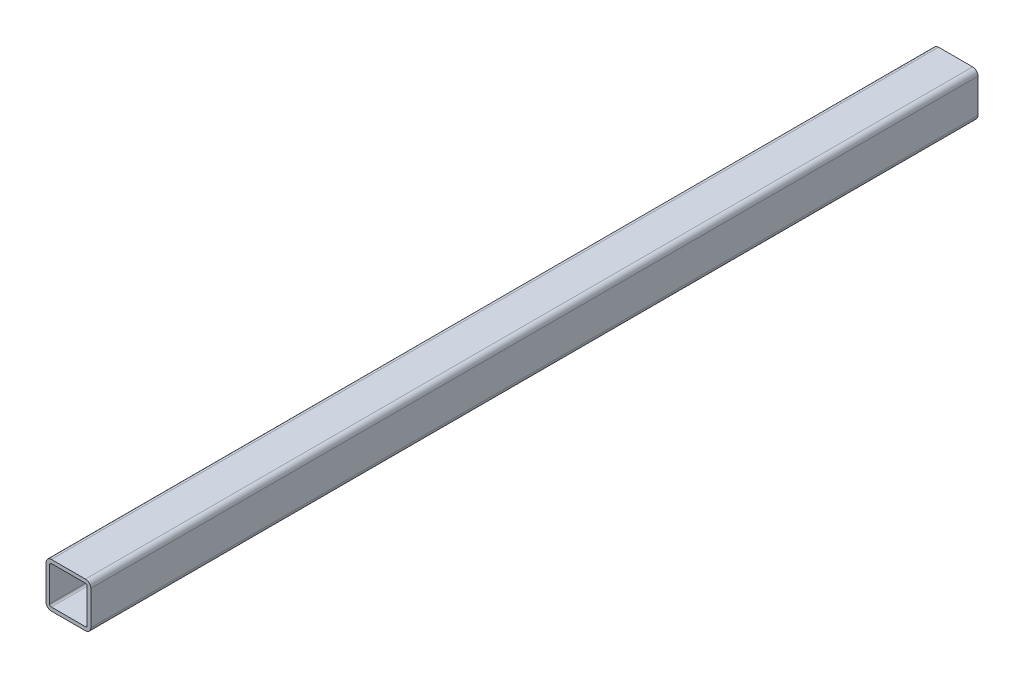
ISO-10303-21;
HEADER;
FILE_DESCRIPTION(('STEP AP214'),'2;1');
FILE_NAME('part.step','',(''),(''),'','','');
FILE_SCHEMA(('AUTOMOTIVE_DESIGN { 1 0 10303 214 1 1 1 1 }'));
ENDSEC;
DATA;
#1=APPLICATION_CONTEXT('core data for automotive mechanical design processes');
#2=APPLICATION_PROTOCOL_DEFINITION('international standard','automotive_design',2000,#1);
#3=PRODUCT_CONTEXT('',#1,'mechanical');
#4=PRODUCT('Part','Part','',(#3));
#5=PRODUCT_RELATED_PRODUCT_CATEGORY('part','',(#4));
#6=PRODUCT_DEFINITION_FORMATION('','',#4);
#7=PRODUCT_DEFINITION_CONTEXT('part definition',#1,'design');
#8=PRODUCT_DEFINITION('design','',#6,#7);
#9=PRODUCT_DEFINITION_SHAPE('','',#8);
#10=(LENGTH_UNIT() NAMED_UNIT(*) SI_UNIT(.MILLI.,.METRE.));
#11=(NAMED_UNIT(*) PLANE_ANGLE_UNIT() SI_UNIT($,.RADIAN.));
#12=(NAMED_UNIT(*) SI_UNIT($,.STERADIAN.) SOLID_ANGLE_UNIT());
#13=UNCERTAINTY_MEASURE_WITH_UNIT(LENGTH_MEASURE(1.E-05),#10,'distance_accuracy_value','');
#14=(GEOMETRIC_REPRESENTATION_CONTEXT(3) GLOBAL_UNCERTAINTY_ASSIGNED_CONTEXT((#13)) GLOBAL_UNIT_ASSIGNED_CONTEXT((#10,
#11,#12)) REPRESENTATION_CONTEXT('',''));
#15=CARTESIAN_POINT('',(0.,0.,0.));
#16=DIRECTION('',(0.,0.,1.));
#17=DIRECTION('',(1.,0.,0.));
#18=AXIS2_PLACEMENT_3D('',#15,#16,#17);
#19=CARTESIAN_POINT('',(0.,0.,495.));
#20=DIRECTION('',(0.,0.,1.));
#21=DIRECTION('',(1.,0.,0.));
#22=AXIS2_PLACEMENT_3D('',#19,#20,#21);
#23=PLANE('',#22);
#24=DIRECTION('',(0.,1.,0.));
#25=VECTOR('',#24,1.);
#26=CARTESIAN_POINT('',(-12.5,-4.75,495.));
#27=LINE('',#26,#25);
#28=CARTESIAN_POINT('',(-12.5,-9.5,495.));
#29=VERTEX_POINT('',#28);
#30=CARTESIAN_POINT('',(-12.5,9.5,495.));
#31=VERTEX_POINT('',#30);
#32=EDGE_CURVE('E273',#29,#31,#27,.T.);
#33=ORIENTED_EDGE('',*,*,#32,.F.);
#34=CARTESIAN_POINT('',(-9.5,-9.5,495.));
#35=DIRECTION('',(0.,0.,-1.));
#36=DIRECTION('',(1.,0.,0.));
#37=AXIS2_PLACEMENT_3D('',#34,#35,#36);
#38=CIRCLE('',#37,3.);
#39=CARTESIAN_POINT('',(-9.5,-12.5,495.));
#40=VERTEX_POINT('',#39);
#41=EDGE_CURVE('E238',#40,#29,#38,.T.);
#42=ORIENTED_EDGE('',*,*,#41,.F.);
#43=DIRECTION('',(-1.,0.,0.));
#44=VECTOR('',#43,1.);
#45=CARTESIAN_POINT('',(4.75,-12.5,495.));
#46=LINE('',#45,#44);
#47=CARTESIAN_POINT('',(9.5,-12.5,495.));
#48=VERTEX_POINT('',#47);
#49=EDGE_CURVE('E312',#48,#40,#46,.T.);
#50=ORIENTED_EDGE('',*,*,#49,.F.);
#51=CARTESIAN_POINT('',(9.5,-9.5,495.));
#52=DIRECTION('',(0.,0.,-1.));
#53=DIRECTION('',(0.,1.,0.));
#54=AXIS2_PLACEMENT_3D('',#51,#52,#53);
#55=CIRCLE('',#54,3.);
#56=CARTESIAN_POINT('',(12.5,-9.5,495.));
#57=VERTEX_POINT('',#56);
#58=EDGE_CURVE('E347',#57,#48,#55,.T.);
#59=ORIENTED_EDGE('',*,*,#58,.F.);
#60=DIRECTION('',(0.,-1.,0.));
#61=VECTOR('',#60,1.);
#62=CARTESIAN_POINT('',(12.5,4.75,495.));
#63=LINE('',#62,#61);
#64=CARTESIAN_POINT('',(12.5,9.5,495.));
#65=VERTEX_POINT('',#64);
#66=EDGE_CURVE('E266',#65,#57,#63,.T.);
#67=ORIENTED_EDGE('',*,*,#66,.F.);
#68=CARTESIAN_POINT('',(9.5,9.5,495.));
#69=DIRECTION('',(0.,0.,-1.));
#70=DIRECTION('',(-1.,0.,0.));
#71=AXIS2_PLACEMENT_3D('',#68,#69,#70);
#72=CIRCLE('',#71,3.);
#73=CARTESIAN_POINT('',(9.5,12.5,495.));
#74=VERTEX_POINT('',#73);
#75=EDGE_CURVE('E27',#74,#65,#72,.T.);
#76=ORIENTED_EDGE('',*,*,#75,.F.);
#77=DIRECTION('',(1.,0.,0.));
#78=VECTOR('',#77,1.);
#79=CARTESIAN_POINT('',(-4.75,12.5,495.));
#80=LINE('',#79,#78);
#81=CARTESIAN_POINT('',(-9.5,12.5,495.));
#82=VERTEX_POINT('',#81);
#83=EDGE_CURVE('E104',#82,#74,#80,.T.);
#84=ORIENTED_EDGE('',*,*,#83,.F.);
#85=CARTESIAN_POINT('',(-9.5,9.5,495.));
#86=DIRECTION('',(0.,0.,-1.));
#87=DIRECTION('',(0.,-1.,0.));
#88=AXIS2_PLACEMENT_3D('',#85,#86,#87);
#89=CIRCLE('',#88,3.);
#90=EDGE_CURVE('E256',#31,#82,#89,.T.);
#91=ORIENTED_EDGE('',*,*,#90,.F.);
#92=EDGE_LOOP('',(#33,#42,#50,#59,#67,#76,#84,#91));
#93=FACE_BOUND('',#92,.T.);
#94=DIRECTION('',(-1.,0.,0.));
#95=VECTOR('',#94,1.);
#96=CARTESIAN_POINT('',(-4.75,10.5,495.));
#97=LINE('',#96,#95);
#98=CARTESIAN_POINT('',(9.5,10.5,495.));
#99=VERTEX_POINT('',#98);
#100=CARTESIAN_POINT('',(-9.5,10.5,495.));
#101=VERTEX_POINT('',#100);
#102=EDGE_CURVE('E280',#99,#101,#97,.T.);
#103=ORIENTED_EDGE('',*,*,#102,.F.);
#104=CARTESIAN_POINT('',(9.5,9.5,495.));
#105=DIRECTION('',(0.,0.,1.));
#106=DIRECTION('',(-1.,0.,0.));
#107=AXIS2_PLACEMENT_3D('',#104,#105,#106);
#108=CIRCLE('',#107,1.);
#109=CARTESIAN_POINT('',(10.5,9.5,495.));
#110=VERTEX_POINT('',#109);
#111=EDGE_CURVE('E281',#110,#99,#108,.T.);
#112=ORIENTED_EDGE('',*,*,#111,.F.);
#113=DIRECTION('',(0.,1.,0.));
#114=VECTOR('',#113,1.);
#115=CARTESIAN_POINT('',(10.5,4.75,495.));
#116=LINE('',#115,#114);
#117=CARTESIAN_POINT('',(10.5,-9.5,495.));
#118=VERTEX_POINT('',#117);
#119=EDGE_CURVE('E168',#118,#110,#116,.T.);
#120=ORIENTED_EDGE('',*,*,#119,.F.);
#121=CARTESIAN_POINT('',(9.5,-9.5,495.));
#122=DIRECTION('',(0.,0.,1.));
#123=DIRECTION('',(0.,1.,0.));
#124=AXIS2_PLACEMENT_3D('',#121,#122,#123);
#125=CIRCLE('',#124,1.);
#126=CARTESIAN_POINT('',(9.5,-10.5,495.));
#127=VERTEX_POINT('',#126);
#128=EDGE_CURVE('E197',#127,#118,#125,.T.);
#129=ORIENTED_EDGE('',*,*,#128,.F.);
#130=DIRECTION('',(1.,0.,0.));
#131=VECTOR('',#130,1.);
#132=CARTESIAN_POINT('',(4.75,-10.5,495.));
#133=LINE('',#132,#131);
#134=CARTESIAN_POINT('',(-9.5,-10.5,495.));
#135=VERTEX_POINT('',#134);
#136=EDGE_CURVE('E221',#135,#127,#133,.T.);
#137=ORIENTED_EDGE('',*,*,#136,.F.);
#138=CARTESIAN_POINT('',(-9.5,-9.5,495.));
#139=DIRECTION('',(0.,0.,1.));
#140=DIRECTION('',(1.,0.,0.));
#141=AXIS2_PLACEMENT_3D('',#138,#139,#140);
#142=CIRCLE('',#141,1.);
#143=CARTESIAN_POINT('',(-10.5,-9.5,495.));
#144=VERTEX_POINT('',#143);
#145=EDGE_CURVE('E206',#144,#135,#142,.T.);
#146=ORIENTED_EDGE('',*,*,#145,.F.);
#147=DIRECTION('',(0.,-1.,0.));
#148=VECTOR('',#147,1.);
#149=CARTESIAN_POINT('',(-10.5,-4.75,495.));
#150=LINE('',#149,#148);
#151=CARTESIAN_POINT('',(-10.5,9.5,495.));
#152=VERTEX_POINT('',#151);
#153=EDGE_CURVE('E269',#152,#144,#150,.T.);
#154=ORIENTED_EDGE('',*,*,#153,.F.);
#155=CARTESIAN_POINT('',(-9.5,9.5,495.));
#156=DIRECTION('',(0.,0.,1.));
#157=DIRECTION('',(0.,-1.,0.));
#158=AXIS2_PLACEMENT_3D('',#155,#156,#157);
#159=CIRCLE('',#158,1.);
#160=EDGE_CURVE('E67',#101,#152,#159,.T.);
#161=ORIENTED_EDGE('',*,*,#160,.F.);
#162=EDGE_LOOP('',(#103,#112,#120,#129,#137,#146,#154,#161));
#163=FACE_BOUND('',#162,.T.);
#164=ADVANCED_FACE('F16',(#93,#163),#23,.T.);
#165=CARTESIAN_POINT('',(0.,0.,0.));
#166=DIRECTION('',(0.,0.,1.));
#167=DIRECTION('',(1.,0.,0.));
#168=AXIS2_PLACEMENT_3D('',#165,#166,#167);
#169=PLANE('',#168);
#170=DIRECTION('',(0.,1.,0.));
#171=VECTOR('',#170,1.);
#172=CARTESIAN_POINT('',(-12.5,-4.75,0.));
#173=LINE('',#172,#171);
#174=CARTESIAN_POINT('',(-12.5,-9.5,0.));
#175=VERTEX_POINT('',#174);
#176=CARTESIAN_POINT('',(-12.5,9.5,0.));
#177=VERTEX_POINT('',#176);
#178=EDGE_CURVE('E260',#175,#177,#173,.T.);
#179=ORIENTED_EDGE('',*,*,#178,.T.);
#180=CARTESIAN_POINT('',(-9.5,9.5,0.));
#181=DIRECTION('',(0.,0.,-1.));
#182=DIRECTION('',(0.,-1.,0.));
#183=AXIS2_PLACEMENT_3D('',#180,#181,#182);
#184=CIRCLE('',#183,3.);
#185=CARTESIAN_POINT('',(-9.5,12.5,0.));
#186=VERTEX_POINT('',#185);
#187=EDGE_CURVE('E117',#177,#186,#184,.T.);
#188=ORIENTED_EDGE('',*,*,#187,.T.);
#189=DIRECTION('',(1.,0.,0.));
#190=VECTOR('',#189,1.);
#191=CARTESIAN_POINT('',(-4.75,12.5,0.));
#192=LINE('',#191,#190);
#193=CARTESIAN_POINT('',(9.5,12.5,0.));
#194=VERTEX_POINT('',#193);
#195=EDGE_CURVE('E350',#186,#194,#192,.T.);
#196=ORIENTED_EDGE('',*,*,#195,.T.);
#197=CARTESIAN_POINT('',(9.5,9.5,0.));
#198=DIRECTION('',(0.,0.,-1.));
#199=DIRECTION('',(-1.,0.,0.));
#200=AXIS2_PLACEMENT_3D('',#197,#198,#199);
#201=CIRCLE('',#200,3.);
#202=CARTESIAN_POINT('',(12.5,9.5,0.));
#203=VERTEX_POINT('',#202);
#204=EDGE_CURVE('E11',#194,#203,#201,.T.);
#205=ORIENTED_EDGE('',*,*,#204,.T.);
#206=DIRECTION('',(0.,-1.,0.));
#207=VECTOR('',#206,1.);
#208=CARTESIAN_POINT('',(12.5,4.75,0.));
#209=LINE('',#208,#207);
#210=CARTESIAN_POINT('',(12.5,-9.5,0.));
#211=VERTEX_POINT('',#210);
#212=EDGE_CURVE('E265',#203,#211,#209,.T.);
#213=ORIENTED_EDGE('',*,*,#212,.T.);
#214=CARTESIAN_POINT('',(9.5,-9.5,0.));
#215=DIRECTION('',(0.,0.,-1.));
#216=DIRECTION('',(0.,1.,0.));
#217=AXIS2_PLACEMENT_3D('',#214,#215,#216);
#218=CIRCLE('',#217,3.);
#219=CARTESIAN_POINT('',(9.5,-12.5,0.));
#220=VERTEX_POINT('',#219);
#221=EDGE_CURVE('E320',#211,#220,#218,.T.);
#222=ORIENTED_EDGE('',*,*,#221,.T.);
#223=DIRECTION('',(-1.,0.,0.));
#224=VECTOR('',#223,1.);
#225=CARTESIAN_POINT('',(4.75,-12.5,0.));
#226=LINE('',#225,#224);
#227=CARTESIAN_POINT('',(-9.5,-12.5,0.));
#228=VERTEX_POINT('',#227);
#229=EDGE_CURVE('E243',#220,#228,#226,.T.);
#230=ORIENTED_EDGE('',*,*,#229,.T.);
#231=CARTESIAN_POINT('',(-9.5,-9.5,0.));
#232=DIRECTION('',(0.,0.,-1.));
#233=DIRECTION('',(1.,0.,0.));
#234=AXIS2_PLACEMENT_3D('',#231,#232,#233);
#235=CIRCLE('',#234,3.);
#236=EDGE_CURVE('E276',#228,#175,#235,.T.);
#237=ORIENTED_EDGE('',*,*,#236,.T.);
#238=EDGE_LOOP('',(#179,#188,#196,#205,#213,#222,#230,#237));
#239=FACE_BOUND('',#238,.T.);
#240=DIRECTION('',(-1.,0.,0.));
#241=VECTOR('',#240,1.);
#242=CARTESIAN_POINT('',(-4.75,10.5,0.));
#243=LINE('',#242,#241);
#244=CARTESIAN_POINT('',(9.5,10.5,0.));
#245=VERTEX_POINT('',#244);
#246=CARTESIAN_POINT('',(-9.5,10.5,0.));
#247=VERTEX_POINT('',#246);
#248=EDGE_CURVE('E185',#245,#247,#243,.T.);
#249=ORIENTED_EDGE('',*,*,#248,.T.);
#250=CARTESIAN_POINT('',(-9.5,9.5,0.));
#251=DIRECTION('',(0.,0.,1.));
#252=DIRECTION('',(0.,-1.,0.));
#253=AXIS2_PLACEMENT_3D('',#250,#251,#252);
#254=CIRCLE('',#253,1.);
#255=CARTESIAN_POINT('',(-10.5,9.5,0.));
#256=VERTEX_POINT('',#255);
#257=EDGE_CURVE('E79',#247,#256,#254,.T.);
#258=ORIENTED_EDGE('',*,*,#257,.T.);
#259=DIRECTION('',(0.,-1.,0.));
#260=VECTOR('',#259,1.);
#261=CARTESIAN_POINT('',(-10.5,-4.75,0.));
#262=LINE('',#261,#260);
#263=CARTESIAN_POINT('',(-10.5,-9.5,0.));
#264=VERTEX_POINT('',#263);
#265=EDGE_CURVE('E255',#256,#264,#262,.T.);
#266=ORIENTED_EDGE('',*,*,#265,.T.);
#267=CARTESIAN_POINT('',(-9.5,-9.5,0.));
#268=DIRECTION('',(0.,0.,1.));
#269=DIRECTION('',(1.,0.,0.));
#270=AXIS2_PLACEMENT_3D('',#267,#268,#269);
#271=CIRCLE('',#270,1.);
#272=CARTESIAN_POINT('',(-9.5,-10.5,0.));
#273=VERTEX_POINT('',#272);
#274=EDGE_CURVE('E215',#264,#273,#271,.T.);
#275=ORIENTED_EDGE('',*,*,#274,.T.);
#276=DIRECTION('',(1.,0.,0.));
#277=VECTOR('',#276,1.);
#278=CARTESIAN_POINT('',(4.75,-10.5,0.));
#279=LINE('',#278,#277);
#280=CARTESIAN_POINT('',(9.5,-10.5,0.));
#281=VERTEX_POINT('',#280);
#282=EDGE_CURVE('E223',#273,#281,#279,.T.);
#283=ORIENTED_EDGE('',*,*,#282,.T.);
#284=CARTESIAN_POINT('',(9.5,-9.5,0.));
#285=DIRECTION('',(0.,0.,1.));
#286=DIRECTION('',(0.,1.,0.));
#287=AXIS2_PLACEMENT_3D('',#284,#285,#286);
#288=CIRCLE('',#287,1.);
#289=CARTESIAN_POINT('',(10.5,-9.5,0.));
#290=VERTEX_POINT('',#289);
#291=EDGE_CURVE('E236',#281,#290,#288,.T.);
#292=ORIENTED_EDGE('',*,*,#291,.T.);
#293=DIRECTION('',(0.,1.,0.));
#294=VECTOR('',#293,1.);
#295=CARTESIAN_POINT('',(10.5,4.75,0.));
#296=LINE('',#295,#294);
#297=CARTESIAN_POINT('',(10.5,9.5,0.));
#298=VERTEX_POINT('',#297);
#299=EDGE_CURVE('E159',#290,#298,#296,.T.);
#300=ORIENTED_EDGE('',*,*,#299,.T.);
#301=CARTESIAN_POINT('',(9.5,9.5,0.));
#302=DIRECTION('',(0.,0.,1.));
#303=DIRECTION('',(-1.,0.,0.));
#304=AXIS2_PLACEMENT_3D('',#301,#302,#303);
#305=CIRCLE('',#304,1.);
#306=EDGE_CURVE('E363',#298,#245,#305,.T.);
#307=ORIENTED_EDGE('',*,*,#306,.T.);
#308=EDGE_LOOP('',(#249,#258,#266,#275,#283,#292,#300,#307));
#309=FACE_BOUND('',#308,.T.);
#310=ADVANCED_FACE('F290',(#239,#309),#169,.F.);
#311=CARTESIAN_POINT('',(9.5,9.5,0.));
#312=DIRECTION('',(0.,0.,1.));
#313=DIRECTION('',(-1.,0.,0.));
#314=AXIS2_PLACEMENT_3D('',#311,#312,#313);
#315=CYLINDRICAL_SURFACE('',#314,3.);
#316=ORIENTED_EDGE('',*,*,#75,.T.);
#317=DIRECTION('',(0.,0.,1.));
#318=VECTOR('',#317,1.);
#319=CARTESIAN_POINT('',(12.5,9.5,0.));
#320=LINE('',#319,#318);
#321=EDGE_CURVE('E344',#203,#65,#320,.T.);
#322=ORIENTED_EDGE('',*,*,#321,.F.);
#323=ORIENTED_EDGE('',*,*,#204,.F.);
#324=DIRECTION('',(0.,0.,1.));
#325=VECTOR('',#324,1.);
#326=CARTESIAN_POINT('',(9.5,12.5,0.));
#327=LINE('',#326,#325);
#328=EDGE_CURVE('E353',#194,#74,#327,.T.);
#329=ORIENTED_EDGE('',*,*,#328,.T.);
#330=EDGE_LOOP('',(#316,#322,#323,#329));
#331=FACE_BOUND('',#330,.T.);
#332=ADVANCED_FACE('F513',(#331),#315,.T.);
#333=CARTESIAN_POINT('',(-9.5,12.5,0.));
#334=DIRECTION('',(0.,1.,0.));
#335=DIRECTION('',(1.,0.,0.));
#336=AXIS2_PLACEMENT_3D('',#333,#334,#335);
#337=PLANE('',#336);
#338=ORIENTED_EDGE('',*,*,#83,.T.);
#339=ORIENTED_EDGE('',*,*,#328,.F.);
#340=ORIENTED_EDGE('',*,*,#195,.F.);
#341=DIRECTION('',(0.,0.,1.));
#342=VECTOR('',#341,1.);
#343=CARTESIAN_POINT('',(-9.5,12.5,0.));
#344=LINE('',#343,#342);
#345=EDGE_CURVE('E20',#186,#82,#344,.T.);
#346=ORIENTED_EDGE('',*,*,#345,.T.);
#347=EDGE_LOOP('',(#338,#339,#340,#346));
#348=FACE_BOUND('',#347,.T.);
#349=ADVANCED_FACE('F524',(#348),#337,.T.);
#350=CARTESIAN_POINT('',(-9.5,9.5,0.));
#351=DIRECTION('',(0.,0.,1.));
#352=DIRECTION('',(0.,-1.,0.));
#353=AXIS2_PLACEMENT_3D('',#350,#351,#352);
#354=CYLINDRICAL_SURFACE('',#353,3.);
#355=ORIENTED_EDGE('',*,*,#90,.T.);
#356=ORIENTED_EDGE('',*,*,#345,.F.);
#357=ORIENTED_EDGE('',*,*,#187,.F.);
#358=DIRECTION('',(0.,0.,1.));
#359=VECTOR('',#358,1.);
#360=CARTESIAN_POINT('',(-12.5,9.5,0.));
#361=LINE('',#360,#359);
#362=EDGE_CURVE('E270',#177,#31,#361,.T.);
#363=ORIENTED_EDGE('',*,*,#362,.T.);
#364=EDGE_LOOP('',(#355,#356,#357,#363));
#365=FACE_BOUND('',#364,.T.);
#366=ADVANCED_FACE('F298',(#365),#354,.T.);
#367=CARTESIAN_POINT('',(-12.5,-9.5,0.));
#368=DIRECTION('',(-1.,0.,0.));
#369=DIRECTION('',(0.,1.,0.));
#370=AXIS2_PLACEMENT_3D('',#367,#368,#369);
#371=PLANE('',#370);
#372=ORIENTED_EDGE('',*,*,#32,.T.);
#373=ORIENTED_EDGE('',*,*,#362,.F.);
#374=ORIENTED_EDGE('',*,*,#178,.F.);
#375=DIRECTION('',(0.,0.,1.));
#376=VECTOR('',#375,1.);
#377=CARTESIAN_POINT('',(-12.5,-9.5,0.));
#378=LINE('',#377,#376);
#379=EDGE_CURVE('E242',#175,#29,#378,.T.);
#380=ORIENTED_EDGE('',*,*,#379,.T.);
#381=EDGE_LOOP('',(#372,#373,#374,#380));
#382=FACE_BOUND('',#381,.T.);
#383=ADVANCED_FACE('F18',(#382),#371,.T.);
#384=CARTESIAN_POINT('',(-9.5,9.5,0.));
#385=DIRECTION('',(0.,0.,1.));
#386=DIRECTION('',(0.,-1.,0.));
#387=AXIS2_PLACEMENT_3D('',#384,#385,#386);
#388=CYLINDRICAL_SURFACE('',#387,1.);
#389=ORIENTED_EDGE('',*,*,#160,.T.);
#390=DIRECTION('',(0.,0.,1.));
#391=VECTOR('',#390,1.);
#392=CARTESIAN_POINT('',(-10.5,9.5,0.));
#393=LINE('',#392,#391);
#394=EDGE_CURVE('E251',#256,#152,#393,.T.);
#395=ORIENTED_EDGE('',*,*,#394,.F.);
#396=ORIENTED_EDGE('',*,*,#257,.F.);
#397=DIRECTION('',(0.,0.,1.));
#398=VECTOR('',#397,1.);
#399=CARTESIAN_POINT('',(-9.5,10.5,0.));
#400=LINE('',#399,#398);
#401=EDGE_CURVE('E343',#247,#101,#400,.T.);
#402=ORIENTED_EDGE('',*,*,#401,.T.);
#403=EDGE_LOOP('',(#389,#395,#396,#402));
#404=FACE_BOUND('',#403,.T.);
#405=ADVANCED_FACE('F497',(#404),#388,.F.);
#406=CARTESIAN_POINT('',(-10.5,-9.5,0.));
#407=DIRECTION('',(-1.,0.,0.));
#408=DIRECTION('',(0.,0.,1.));
#409=AXIS2_PLACEMENT_3D('',#406,#407,#408);
#410=PLANE('',#409);
#411=ORIENTED_EDGE('',*,*,#153,.T.);
#412=DIRECTION('',(0.,0.,1.));
#413=VECTOR('',#412,1.);
#414=CARTESIAN_POINT('',(-10.5,-9.5,0.));
#415=LINE('',#414,#413);
#416=EDGE_CURVE('E213',#264,#144,#415,.T.);
#417=ORIENTED_EDGE('',*,*,#416,.F.);
#418=ORIENTED_EDGE('',*,*,#265,.F.);
#419=ORIENTED_EDGE('',*,*,#394,.T.);
#420=EDGE_LOOP('',(#411,#417,#418,#419));
#421=FACE_BOUND('',#420,.T.);
#422=ADVANCED_FACE('F496',(#421),#410,.F.);
#423=CARTESIAN_POINT('',(-9.5,-9.5,0.));
#424=DIRECTION('',(0.,0.,1.));
#425=DIRECTION('',(1.,0.,0.));
#426=AXIS2_PLACEMENT_3D('',#423,#424,#425);
#427=CYLINDRICAL_SURFACE('',#426,1.);
#428=ORIENTED_EDGE('',*,*,#145,.T.);
#429=DIRECTION('',(0.,0.,1.));
#430=VECTOR('',#429,1.);
#431=CARTESIAN_POINT('',(-9.5,-10.5,0.));
#432=LINE('',#431,#430);
#433=EDGE_CURVE('E210',#273,#135,#432,.T.);
#434=ORIENTED_EDGE('',*,*,#433,.F.);
#435=ORIENTED_EDGE('',*,*,#274,.F.);
#436=ORIENTED_EDGE('',*,*,#416,.T.);
#437=EDGE_LOOP('',(#428,#434,#435,#436));
#438=FACE_BOUND('',#437,.T.);
#439=ADVANCED_FACE('F208',(#438),#427,.F.);
#440=CARTESIAN_POINT('',(-9.5,10.5,0.));
#441=DIRECTION('',(0.,1.,0.));
#442=DIRECTION('',(1.,0.,0.));
#443=AXIS2_PLACEMENT_3D('',#440,#441,#442);
#444=PLANE('',#443);
#445=ORIENTED_EDGE('',*,*,#102,.T.);
#446=ORIENTED_EDGE('',*,*,#401,.F.);
#447=ORIENTED_EDGE('',*,*,#248,.F.);
#448=DIRECTION('',(0.,0.,1.));
#449=VECTOR('',#448,1.);
#450=CARTESIAN_POINT('',(9.5,10.5,0.));
#451=LINE('',#450,#449);
#452=EDGE_CURVE('E284',#245,#99,#451,.T.);
#453=ORIENTED_EDGE('',*,*,#452,.T.);
#454=EDGE_LOOP('',(#445,#446,#447,#453));
#455=FACE_BOUND('',#454,.T.);
#456=ADVANCED_FACE('F487',(#455),#444,.F.);
#457=CARTESIAN_POINT('',(-9.5,-9.5,0.));
#458=DIRECTION('',(0.,0.,1.));
#459=DIRECTION('',(1.,0.,0.));
#460=AXIS2_PLACEMENT_3D('',#457,#458,#459);
#461=CYLINDRICAL_SURFACE('',#460,3.);
#462=ORIENTED_EDGE('',*,*,#41,.T.);
#463=ORIENTED_EDGE('',*,*,#379,.F.);
#464=ORIENTED_EDGE('',*,*,#236,.F.);
#465=DIRECTION('',(0.,0.,1.));
#466=VECTOR('',#465,1.);
#467=CARTESIAN_POINT('',(-9.5,-12.5,0.));
#468=LINE('',#467,#466);
#469=EDGE_CURVE('E308',#228,#40,#468,.T.);
#470=ORIENTED_EDGE('',*,*,#469,.T.);
#471=EDGE_LOOP('',(#462,#463,#464,#470));
#472=FACE_BOUND('',#471,.T.);
#473=ADVANCED_FACE('F306',(#472),#461,.T.);
#474=CARTESIAN_POINT('',(9.5,-12.5,0.));
#475=DIRECTION('',(0.,-1.,0.));
#476=DIRECTION('',(0.,0.,-1.));
#477=AXIS2_PLACEMENT_3D('',#474,#475,#476);
#478=PLANE('',#477);
#479=ORIENTED_EDGE('',*,*,#49,.T.);
#480=ORIENTED_EDGE('',*,*,#469,.F.);
#481=ORIENTED_EDGE('',*,*,#229,.F.);
#482=DIRECTION('',(0.,0.,1.));
#483=VECTOR('',#482,1.);
#484=CARTESIAN_POINT('',(9.5,-12.5,0.));
#485=LINE('',#484,#483);
#486=EDGE_CURVE('E317',#220,#48,#485,.T.);
#487=ORIENTED_EDGE('',*,*,#486,.T.);
#488=EDGE_LOOP('',(#479,#480,#481,#487));
#489=FACE_BOUND('',#488,.T.);
#490=ADVANCED_FACE('F315',(#489),#478,.T.);
#491=CARTESIAN_POINT('',(9.5,-9.5,0.));
#492=DIRECTION('',(0.,0.,1.));
#493=DIRECTION('',(0.,1.,0.));
#494=AXIS2_PLACEMENT_3D('',#491,#492,#493);
#495=CYLINDRICAL_SURFACE('',#494,3.);
#496=ORIENTED_EDGE('',*,*,#58,.T.);
#497=ORIENTED_EDGE('',*,*,#486,.F.);
#498=ORIENTED_EDGE('',*,*,#221,.F.);
#499=DIRECTION('',(0.,0.,1.));
#500=VECTOR('',#499,1.);
#501=CARTESIAN_POINT('',(12.5,-9.5,0.));
#502=LINE('',#501,#500);
#503=EDGE_CURVE('E261',#211,#57,#502,.T.);
#504=ORIENTED_EDGE('',*,*,#503,.T.);
#505=EDGE_LOOP('',(#496,#497,#498,#504));
#506=FACE_BOUND('',#505,.T.);
#507=ADVANCED_FACE('F521',(#506),#495,.T.);
#508=CARTESIAN_POINT('',(12.5,9.5,0.));
#509=DIRECTION('',(1.,0.,0.));
#510=DIRECTION('',(0.,1.,0.));
#511=AXIS2_PLACEMENT_3D('',#508,#509,#510);
#512=PLANE('',#511);
#513=ORIENTED_EDGE('',*,*,#66,.T.);
#514=ORIENTED_EDGE('',*,*,#503,.F.);
#515=ORIENTED_EDGE('',*,*,#212,.F.);
#516=ORIENTED_EDGE('',*,*,#321,.T.);
#517=EDGE_LOOP('',(#513,#514,#515,#516));
#518=FACE_BOUND('',#517,.T.);
#519=ADVANCED_FACE('F517',(#518),#512,.T.);
#520=CARTESIAN_POINT('',(9.5,9.5,0.));
#521=DIRECTION('',(0.,0.,1.));
#522=DIRECTION('',(-1.,0.,0.));
#523=AXIS2_PLACEMENT_3D('',#520,#521,#522);
#524=CYLINDRICAL_SURFACE('',#523,1.);
#525=ORIENTED_EDGE('',*,*,#111,.T.);
#526=ORIENTED_EDGE('',*,*,#452,.F.);
#527=ORIENTED_EDGE('',*,*,#306,.F.);
#528=DIRECTION('',(0.,0.,1.));
#529=VECTOR('',#528,1.);
#530=CARTESIAN_POINT('',(10.5,9.5,0.));
#531=LINE('',#530,#529);
#532=EDGE_CURVE('E244',#298,#110,#531,.T.);
#533=ORIENTED_EDGE('',*,*,#532,.T.);
#534=EDGE_LOOP('',(#525,#526,#527,#533));
#535=FACE_BOUND('',#534,.T.);
#536=ADVANCED_FACE('F489',(#535),#524,.F.);
#537=CARTESIAN_POINT('',(10.5,9.5,0.));
#538=DIRECTION('',(1.,0.,0.));
#539=DIRECTION('',(0.,-1.,0.));
#540=AXIS2_PLACEMENT_3D('',#537,#538,#539);
#541=PLANE('',#540);
#542=ORIENTED_EDGE('',*,*,#119,.T.);
#543=ORIENTED_EDGE('',*,*,#532,.F.);
#544=ORIENTED_EDGE('',*,*,#299,.F.);
#545=DIRECTION('',(0.,0.,1.));
#546=VECTOR('',#545,1.);
#547=CARTESIAN_POINT('',(10.5,-9.5,0.));
#548=LINE('',#547,#546);
#549=EDGE_CURVE('E248',#290,#118,#548,.T.);
#550=ORIENTED_EDGE('',*,*,#549,.T.);
#551=EDGE_LOOP('',(#542,#543,#544,#550));
#552=FACE_BOUND('',#551,.T.);
#553=ADVANCED_FACE('F490',(#552),#541,.F.);
#554=CARTESIAN_POINT('',(9.5,-9.5,0.));
#555=DIRECTION('',(0.,0.,1.));
#556=DIRECTION('',(0.,1.,0.));
#557=AXIS2_PLACEMENT_3D('',#554,#555,#556);
#558=CYLINDRICAL_SURFACE('',#557,1.);
#559=ORIENTED_EDGE('',*,*,#128,.T.);
#560=ORIENTED_EDGE('',*,*,#549,.F.);
#561=ORIENTED_EDGE('',*,*,#291,.F.);
#562=DIRECTION('',(0.,0.,1.));
#563=VECTOR('',#562,1.);
#564=CARTESIAN_POINT('',(9.5,-10.5,0.));
#565=LINE('',#564,#563);
#566=EDGE_CURVE('E227',#281,#127,#565,.T.);
#567=ORIENTED_EDGE('',*,*,#566,.T.);
#568=EDGE_LOOP('',(#559,#560,#561,#567));
#569=FACE_BOUND('',#568,.T.);
#570=ADVANCED_FACE('F493',(#569),#558,.F.);
#571=CARTESIAN_POINT('',(9.5,-10.5,0.));
#572=DIRECTION('',(0.,-1.,0.));
#573=DIRECTION('',(0.,0.,-1.));
#574=AXIS2_PLACEMENT_3D('',#571,#572,#573);
#575=PLANE('',#574);
#576=ORIENTED_EDGE('',*,*,#136,.T.);
#577=ORIENTED_EDGE('',*,*,#566,.F.);
#578=ORIENTED_EDGE('',*,*,#282,.F.);
#579=ORIENTED_EDGE('',*,*,#433,.T.);
#580=EDGE_LOOP('',(#576,#577,#578,#579));
#581=FACE_BOUND('',#580,.T.);
#582=ADVANCED_FACE('F219',(#581),#575,.F.);
#583=CLOSED_SHELL('',(#164,#310,#332,#349,#366,#383,#405,#422,#439,#456,#473,#490,#507,#519,
#536,#553,#570,#582));
#584=MANIFOLD_SOLID_BREP('B1',#583);
#585=ADVANCED_BREP_SHAPE_REPRESENTATION('',(#18,#584),#14);
#586=SHAPE_DEFINITION_REPRESENTATION(#9,#585);
ENDSEC;
END-ISO-10303-21;
